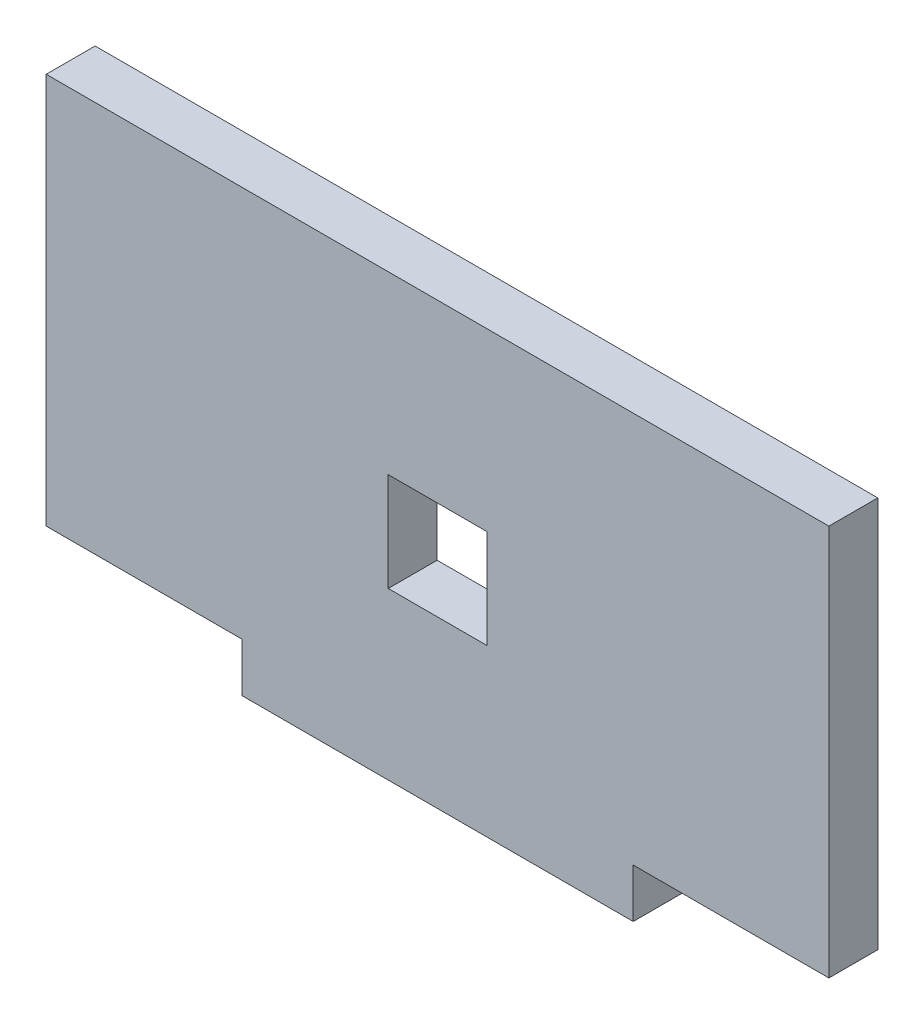
ISO-10303-21;
HEADER;
FILE_DESCRIPTION(('STEP AP214'),'2;1');
FILE_NAME('part.step','',(''),(''),'','','');
FILE_SCHEMA(('AUTOMOTIVE_DESIGN { 1 0 10303 214 1 1 1 1 }'));
ENDSEC;
DATA;
#1=APPLICATION_CONTEXT('core data for automotive mechanical design processes');
#2=APPLICATION_PROTOCOL_DEFINITION('international standard','automotive_design',2000,#1);
#3=PRODUCT_CONTEXT('',#1,'mechanical');
#4=PRODUCT('Part','Part','',(#3));
#5=PRODUCT_RELATED_PRODUCT_CATEGORY('part','',(#4));
#6=PRODUCT_DEFINITION_FORMATION('','',#4);
#7=PRODUCT_DEFINITION_CONTEXT('part definition',#1,'design');
#8=PRODUCT_DEFINITION('design','',#6,#7);
#9=PRODUCT_DEFINITION_SHAPE('','',#8);
#10=(LENGTH_UNIT() NAMED_UNIT(*) SI_UNIT(.MILLI.,.METRE.));
#11=(NAMED_UNIT(*) PLANE_ANGLE_UNIT() SI_UNIT($,.RADIAN.));
#12=(NAMED_UNIT(*) SI_UNIT($,.STERADIAN.) SOLID_ANGLE_UNIT());
#13=UNCERTAINTY_MEASURE_WITH_UNIT(LENGTH_MEASURE(1.E-05),#10,'distance_accuracy_value','');
#14=(GEOMETRIC_REPRESENTATION_CONTEXT(3) GLOBAL_UNCERTAINTY_ASSIGNED_CONTEXT((#13)) GLOBAL_UNIT_ASSIGNED_CONTEXT((#10,
#11,#12)) REPRESENTATION_CONTEXT('',''));
#15=CARTESIAN_POINT('',(0.,0.,0.));
#16=DIRECTION('',(0.,0.,1.));
#17=DIRECTION('',(1.,0.,0.));
#18=AXIS2_PLACEMENT_3D('',#15,#16,#17);
#19=CARTESIAN_POINT('',(25.4,-14.2875,3.175));
#20=DIRECTION('',(-1.,0.,0.));
#21=DIRECTION('',(0.,0.,1.));
#22=AXIS2_PLACEMENT_3D('',#19,#20,#21);
#23=PLANE('',#22);
#24=DIRECTION('',(0.,1.,0.));
#25=VECTOR('',#24,1.);
#26=CARTESIAN_POINT('',(25.4,-14.2875,3.175));
#27=LINE('',#26,#25);
#28=CARTESIAN_POINT('',(25.4,-11.1125,3.175));
#29=VERTEX_POINT('',#28);
#30=CARTESIAN_POINT('',(25.4,14.2875,3.175));
#31=VERTEX_POINT('',#30);
#32=EDGE_CURVE('E136',#29,#31,#27,.T.);
#33=ORIENTED_EDGE('',*,*,#32,.F.);
#34=DIRECTION('',(0.,0.,1.));
#35=VECTOR('',#34,1.);
#36=CARTESIAN_POINT('',(25.4,-11.1125,0.));
#37=LINE('',#36,#35);
#38=CARTESIAN_POINT('',(25.4,-11.1125,0.));
#39=VERTEX_POINT('',#38);
#40=EDGE_CURVE('E124',#39,#29,#37,.T.);
#41=ORIENTED_EDGE('',*,*,#40,.F.);
#42=DIRECTION('',(0.,1.,0.));
#43=VECTOR('',#42,1.);
#44=CARTESIAN_POINT('',(25.4,-14.2875,0.));
#45=LINE('',#44,#43);
#46=CARTESIAN_POINT('',(25.4,14.2875,0.));
#47=VERTEX_POINT('',#46);
#48=EDGE_CURVE('E134',#39,#47,#45,.T.);
#49=ORIENTED_EDGE('',*,*,#48,.T.);
#50=DIRECTION('',(0.,0.,-1.));
#51=VECTOR('',#50,1.);
#52=CARTESIAN_POINT('',(25.4,14.2875,3.175));
#53=LINE('',#52,#51);
#54=EDGE_CURVE('E11',#31,#47,#53,.T.);
#55=ORIENTED_EDGE('',*,*,#54,.F.);
#56=EDGE_LOOP('',(#33,#41,#49,#55));
#57=FACE_BOUND('',#56,.T.);
#58=ADVANCED_FACE('F33',(#57),#23,.F.);
#59=CARTESIAN_POINT('',(-25.4,14.2875,3.175));
#60=DIRECTION('',(0.,-1.,0.));
#61=DIRECTION('',(0.,0.,-1.));
#62=AXIS2_PLACEMENT_3D('',#59,#60,#61);
#63=PLANE('',#62);
#64=DIRECTION('',(-1.,0.,0.));
#65=VECTOR('',#64,1.);
#66=CARTESIAN_POINT('',(-25.4,14.2875,0.));
#67=LINE('',#66,#65);
#68=CARTESIAN_POINT('',(-25.4,14.2875,0.));
#69=VERTEX_POINT('',#68);
#70=EDGE_CURVE('E141',#47,#69,#67,.T.);
#71=ORIENTED_EDGE('',*,*,#70,.T.);
#72=DIRECTION('',(0.,0.,-1.));
#73=VECTOR('',#72,1.);
#74=CARTESIAN_POINT('',(-25.4,14.2875,3.175));
#75=LINE('',#74,#73);
#76=CARTESIAN_POINT('',(-25.4,14.2875,3.175));
#77=VERTEX_POINT('',#76);
#78=EDGE_CURVE('E40',#77,#69,#75,.T.);
#79=ORIENTED_EDGE('',*,*,#78,.F.);
#80=DIRECTION('',(-1.,0.,0.));
#81=VECTOR('',#80,1.);
#82=CARTESIAN_POINT('',(-25.4,14.2875,3.175));
#83=LINE('',#82,#81);
#84=EDGE_CURVE('E168',#31,#77,#83,.T.);
#85=ORIENTED_EDGE('',*,*,#84,.F.);
#86=ORIENTED_EDGE('',*,*,#54,.T.);
#87=EDGE_LOOP('',(#71,#79,#85,#86));
#88=FACE_BOUND('',#87,.T.);
#89=ADVANCED_FACE('F236',(#88),#63,.F.);
#90=CARTESIAN_POINT('',(-25.4,-14.2875,3.175));
#91=DIRECTION('',(1.,0.,0.));
#92=DIRECTION('',(0.,0.,-1.));
#93=AXIS2_PLACEMENT_3D('',#90,#91,#92);
#94=PLANE('',#93);
#95=DIRECTION('',(0.,-1.,0.));
#96=VECTOR('',#95,1.);
#97=CARTESIAN_POINT('',(-25.4,-14.2875,0.));
#98=LINE('',#97,#96);
#99=CARTESIAN_POINT('',(-25.4,-11.1125,0.));
#100=VERTEX_POINT('',#99);
#101=EDGE_CURVE('E144',#69,#100,#98,.T.);
#102=ORIENTED_EDGE('',*,*,#101,.T.);
#103=DIRECTION('',(0.,0.,1.));
#104=VECTOR('',#103,1.);
#105=CARTESIAN_POINT('',(-25.4,-11.1125,0.));
#106=LINE('',#105,#104);
#107=CARTESIAN_POINT('',(-25.4,-11.1125,3.175));
#108=VERTEX_POINT('',#107);
#109=EDGE_CURVE('E142',#100,#108,#106,.T.);
#110=ORIENTED_EDGE('',*,*,#109,.T.);
#111=DIRECTION('',(0.,-1.,0.));
#112=VECTOR('',#111,1.);
#113=CARTESIAN_POINT('',(-25.4,-14.2875,3.175));
#114=LINE('',#113,#112);
#115=EDGE_CURVE('E162',#77,#108,#114,.T.);
#116=ORIENTED_EDGE('',*,*,#115,.F.);
#117=ORIENTED_EDGE('',*,*,#78,.T.);
#118=EDGE_LOOP('',(#102,#110,#116,#117));
#119=FACE_BOUND('',#118,.T.);
#120=ADVANCED_FACE('F234',(#119),#94,.F.);
#121=CARTESIAN_POINT('',(-25.4,-14.2875,3.175));
#122=DIRECTION('',(0.,1.,0.));
#123=DIRECTION('',(0.,0.,1.));
#124=AXIS2_PLACEMENT_3D('',#121,#122,#123);
#125=PLANE('',#124);
#126=DIRECTION('',(1.,0.,0.));
#127=VECTOR('',#126,1.);
#128=CARTESIAN_POINT('',(-25.4,-14.2875,0.));
#129=LINE('',#128,#127);
#130=CARTESIAN_POINT('',(-12.7,-14.2875,0.));
#131=VERTEX_POINT('',#130);
#132=CARTESIAN_POINT('',(12.7,-14.2875,0.));
#133=VERTEX_POINT('',#132);
#134=EDGE_CURVE('E155',#131,#133,#129,.T.);
#135=ORIENTED_EDGE('',*,*,#134,.T.);
#136=DIRECTION('',(0.,0.,1.));
#137=VECTOR('',#136,1.);
#138=CARTESIAN_POINT('',(12.7,-14.2875,0.));
#139=LINE('',#138,#137);
#140=CARTESIAN_POINT('',(12.7,-14.2875,3.175));
#141=VERTEX_POINT('',#140);
#142=EDGE_CURVE('E183',#133,#141,#139,.T.);
#143=ORIENTED_EDGE('',*,*,#142,.T.);
#144=DIRECTION('',(1.,0.,0.));
#145=VECTOR('',#144,1.);
#146=CARTESIAN_POINT('',(-25.4,-14.2875,3.175));
#147=LINE('',#146,#145);
#148=CARTESIAN_POINT('',(-12.7,-14.2875,3.175));
#149=VERTEX_POINT('',#148);
#150=EDGE_CURVE('E150',#149,#141,#147,.T.);
#151=ORIENTED_EDGE('',*,*,#150,.F.);
#152=DIRECTION('',(0.,0.,1.));
#153=VECTOR('',#152,1.);
#154=CARTESIAN_POINT('',(-12.7,-14.2875,0.));
#155=LINE('',#154,#153);
#156=EDGE_CURVE('E173',#131,#149,#155,.T.);
#157=ORIENTED_EDGE('',*,*,#156,.F.);
#158=EDGE_LOOP('',(#135,#143,#151,#157));
#159=FACE_BOUND('',#158,.T.);
#160=ADVANCED_FACE('F227',(#159),#125,.F.);
#161=CARTESIAN_POINT('',(0.,0.,3.175));
#162=DIRECTION('',(0.,0.,-1.));
#163=DIRECTION('',(-1.,0.,0.));
#164=AXIS2_PLACEMENT_3D('',#161,#162,#163);
#165=PLANE('',#164);
#166=DIRECTION('',(-1.,0.,0.));
#167=VECTOR('',#166,1.);
#168=CARTESIAN_POINT('',(-3.2004,2.88290000000001,3.175));
#169=LINE('',#168,#167);
#170=CARTESIAN_POINT('',(3.2004,2.88290000000001,3.175));
#171=VERTEX_POINT('',#170);
#172=CARTESIAN_POINT('',(-3.2004,2.88290000000001,3.175));
#173=VERTEX_POINT('',#172);
#174=EDGE_CURVE('E205',#171,#173,#169,.T.);
#175=ORIENTED_EDGE('',*,*,#174,.F.);
#176=DIRECTION('',(0.,1.,0.));
#177=VECTOR('',#176,1.);
#178=CARTESIAN_POINT('',(3.2004,-3.51789999999999,3.175));
#179=LINE('',#178,#177);
#180=CARTESIAN_POINT('',(3.2004,-3.51789999999999,3.175));
#181=VERTEX_POINT('',#180);
#182=EDGE_CURVE('E47',#181,#171,#179,.T.);
#183=ORIENTED_EDGE('',*,*,#182,.F.);
#184=DIRECTION('',(1.,0.,0.));
#185=VECTOR('',#184,1.);
#186=CARTESIAN_POINT('',(-3.2004,-3.51789999999999,3.175));
#187=LINE('',#186,#185);
#188=CARTESIAN_POINT('',(-3.2004,-3.51789999999999,3.175));
#189=VERTEX_POINT('',#188);
#190=EDGE_CURVE('E198',#189,#181,#187,.T.);
#191=ORIENTED_EDGE('',*,*,#190,.F.);
#192=DIRECTION('',(0.,-1.,0.));
#193=VECTOR('',#192,1.);
#194=CARTESIAN_POINT('',(-3.2004,-3.51789999999999,3.175));
#195=LINE('',#194,#193);
#196=EDGE_CURVE('E202',#173,#189,#195,.T.);
#197=ORIENTED_EDGE('',*,*,#196,.F.);
#198=EDGE_LOOP('',(#175,#183,#191,#197));
#199=FACE_BOUND('',#198,.T.);
#200=ORIENTED_EDGE('',*,*,#150,.T.);
#201=DIRECTION('',(0.,-1.,0.));
#202=VECTOR('',#201,1.);
#203=CARTESIAN_POINT('',(12.7,-14.2875,3.175));
#204=LINE('',#203,#202);
#205=CARTESIAN_POINT('',(12.7,-11.1125,3.175));
#206=VERTEX_POINT('',#205);
#207=EDGE_CURVE('E129',#206,#141,#204,.T.);
#208=ORIENTED_EDGE('',*,*,#207,.F.);
#209=DIRECTION('',(-1.,0.,0.));
#210=VECTOR('',#209,1.);
#211=CARTESIAN_POINT('',(25.4,-11.1125,3.175));
#212=LINE('',#211,#210);
#213=EDGE_CURVE('E197',#29,#206,#212,.T.);
#214=ORIENTED_EDGE('',*,*,#213,.F.);
#215=ORIENTED_EDGE('',*,*,#32,.T.);
#216=ORIENTED_EDGE('',*,*,#84,.T.);
#217=ORIENTED_EDGE('',*,*,#115,.T.);
#218=DIRECTION('',(-1.,0.,0.));
#219=VECTOR('',#218,1.);
#220=CARTESIAN_POINT('',(-25.4,-11.1125,3.175));
#221=LINE('',#220,#219);
#222=CARTESIAN_POINT('',(-12.7,-11.1125,3.175));
#223=VERTEX_POINT('',#222);
#224=EDGE_CURVE('E177',#223,#108,#221,.T.);
#225=ORIENTED_EDGE('',*,*,#224,.F.);
#226=DIRECTION('',(0.,1.,0.));
#227=VECTOR('',#226,1.);
#228=CARTESIAN_POINT('',(-12.7,-14.2875,3.175));
#229=LINE('',#228,#227);
#230=EDGE_CURVE('E180',#149,#223,#229,.T.);
#231=ORIENTED_EDGE('',*,*,#230,.F.);
#232=EDGE_LOOP('',(#200,#208,#214,#215,#216,#217,#225,#231));
#233=FACE_BOUND('',#232,.T.);
#234=ADVANCED_FACE('F231',(#199,#233),#165,.F.);
#235=CARTESIAN_POINT('',(0.,0.,0.));
#236=DIRECTION('',(0.,0.,-1.));
#237=DIRECTION('',(-1.,0.,0.));
#238=AXIS2_PLACEMENT_3D('',#235,#236,#237);
#239=PLANE('',#238);
#240=DIRECTION('',(0.,-1.,0.));
#241=VECTOR('',#240,1.);
#242=CARTESIAN_POINT('',(12.7,-14.2875,0.));
#243=LINE('',#242,#241);
#244=CARTESIAN_POINT('',(12.7,-11.1125,0.));
#245=VERTEX_POINT('',#244);
#246=EDGE_CURVE('E55',#245,#133,#243,.T.);
#247=ORIENTED_EDGE('',*,*,#246,.T.);
#248=ORIENTED_EDGE('',*,*,#134,.F.);
#249=DIRECTION('',(0.,1.,0.));
#250=VECTOR('',#249,1.);
#251=CARTESIAN_POINT('',(-12.7,-14.2875,0.));
#252=LINE('',#251,#250);
#253=CARTESIAN_POINT('',(-12.7,-11.1125,0.));
#254=VERTEX_POINT('',#253);
#255=EDGE_CURVE('E179',#131,#254,#252,.T.);
#256=ORIENTED_EDGE('',*,*,#255,.T.);
#257=DIRECTION('',(-1.,0.,0.));
#258=VECTOR('',#257,1.);
#259=CARTESIAN_POINT('',(-25.4,-11.1125,0.));
#260=LINE('',#259,#258);
#261=EDGE_CURVE('E175',#254,#100,#260,.T.);
#262=ORIENTED_EDGE('',*,*,#261,.T.);
#263=ORIENTED_EDGE('',*,*,#101,.F.);
#264=ORIENTED_EDGE('',*,*,#70,.F.);
#265=ORIENTED_EDGE('',*,*,#48,.F.);
#266=DIRECTION('',(-1.,0.,0.));
#267=VECTOR('',#266,1.);
#268=CARTESIAN_POINT('',(25.4,-11.1125,0.));
#269=LINE('',#268,#267);
#270=EDGE_CURVE('E120',#39,#245,#269,.T.);
#271=ORIENTED_EDGE('',*,*,#270,.T.);
#272=EDGE_LOOP('',(#247,#248,#256,#262,#263,#264,#265,#271));
#273=FACE_BOUND('',#272,.T.);
#274=DIRECTION('',(0.,1.,0.));
#275=VECTOR('',#274,1.);
#276=CARTESIAN_POINT('',(3.2004,-3.51789999999999,0.));
#277=LINE('',#276,#275);
#278=CARTESIAN_POINT('',(3.2004,-3.51789999999999,0.));
#279=VERTEX_POINT('',#278);
#280=CARTESIAN_POINT('',(3.2004,2.88290000000001,0.));
#281=VERTEX_POINT('',#280);
#282=EDGE_CURVE('E201',#279,#281,#277,.T.);
#283=ORIENTED_EDGE('',*,*,#282,.T.);
#284=DIRECTION('',(-1.,0.,0.));
#285=VECTOR('',#284,1.);
#286=CARTESIAN_POINT('',(-3.2004,2.88290000000001,0.));
#287=LINE('',#286,#285);
#288=CARTESIAN_POINT('',(-3.2004,2.88290000000001,0.));
#289=VERTEX_POINT('',#288);
#290=EDGE_CURVE('E214',#281,#289,#287,.T.);
#291=ORIENTED_EDGE('',*,*,#290,.T.);
#292=DIRECTION('',(0.,-1.,0.));
#293=VECTOR('',#292,1.);
#294=CARTESIAN_POINT('',(-3.2004,-3.51789999999999,0.));
#295=LINE('',#294,#293);
#296=CARTESIAN_POINT('',(-3.2004,-3.51789999999999,0.));
#297=VERTEX_POINT('',#296);
#298=EDGE_CURVE('E211',#289,#297,#295,.T.);
#299=ORIENTED_EDGE('',*,*,#298,.T.);
#300=DIRECTION('',(1.,0.,0.));
#301=VECTOR('',#300,1.);
#302=CARTESIAN_POINT('',(-3.2004,-3.51789999999999,0.));
#303=LINE('',#302,#301);
#304=EDGE_CURVE('E191',#297,#279,#303,.T.);
#305=ORIENTED_EDGE('',*,*,#304,.T.);
#306=EDGE_LOOP('',(#283,#291,#299,#305));
#307=FACE_BOUND('',#306,.T.);
#308=ADVANCED_FACE('F138',(#273,#307),#239,.T.);
#309=CARTESIAN_POINT('',(-25.4,-11.1125,0.));
#310=DIRECTION('',(0.,1.,0.));
#311=DIRECTION('',(0.,0.,1.));
#312=AXIS2_PLACEMENT_3D('',#309,#310,#311);
#313=PLANE('',#312);
#314=ORIENTED_EDGE('',*,*,#224,.T.);
#315=ORIENTED_EDGE('',*,*,#109,.F.);
#316=ORIENTED_EDGE('',*,*,#261,.F.);
#317=DIRECTION('',(0.,0.,1.));
#318=VECTOR('',#317,1.);
#319=CARTESIAN_POINT('',(-12.7,-11.1125,0.));
#320=LINE('',#319,#318);
#321=EDGE_CURVE('E147',#254,#223,#320,.T.);
#322=ORIENTED_EDGE('',*,*,#321,.T.);
#323=EDGE_LOOP('',(#314,#315,#316,#322));
#324=FACE_BOUND('',#323,.T.);
#325=ADVANCED_FACE('F233',(#324),#313,.F.);
#326=CARTESIAN_POINT('',(-12.7,-14.2875,0.));
#327=DIRECTION('',(1.,0.,0.));
#328=DIRECTION('',(0.,0.,-1.));
#329=AXIS2_PLACEMENT_3D('',#326,#327,#328);
#330=PLANE('',#329);
#331=ORIENTED_EDGE('',*,*,#230,.T.);
#332=ORIENTED_EDGE('',*,*,#321,.F.);
#333=ORIENTED_EDGE('',*,*,#255,.F.);
#334=ORIENTED_EDGE('',*,*,#156,.T.);
#335=EDGE_LOOP('',(#331,#332,#333,#334));
#336=FACE_BOUND('',#335,.T.);
#337=ADVANCED_FACE('F229',(#336),#330,.F.);
#338=CARTESIAN_POINT('',(3.2004,-3.51789999999999,0.));
#339=DIRECTION('',(1.,0.,0.));
#340=DIRECTION('',(0.,0.,-1.));
#341=AXIS2_PLACEMENT_3D('',#338,#339,#340);
#342=PLANE('',#341);
#343=ORIENTED_EDGE('',*,*,#182,.T.);
#344=DIRECTION('',(0.,0.,1.));
#345=VECTOR('',#344,1.);
#346=CARTESIAN_POINT('',(3.2004,2.88290000000001,0.));
#347=LINE('',#346,#345);
#348=EDGE_CURVE('E188',#281,#171,#347,.T.);
#349=ORIENTED_EDGE('',*,*,#348,.F.);
#350=ORIENTED_EDGE('',*,*,#282,.F.);
#351=DIRECTION('',(0.,0.,1.));
#352=VECTOR('',#351,1.);
#353=CARTESIAN_POINT('',(3.2004,-3.51789999999999,0.));
#354=LINE('',#353,#352);
#355=EDGE_CURVE('E195',#279,#181,#354,.T.);
#356=ORIENTED_EDGE('',*,*,#355,.T.);
#357=EDGE_LOOP('',(#343,#349,#350,#356));
#358=FACE_BOUND('',#357,.T.);
#359=ADVANCED_FACE('F294',(#358),#342,.F.);
#360=CARTESIAN_POINT('',(-3.2004,-3.51789999999999,0.));
#361=DIRECTION('',(0.,-1.,0.));
#362=DIRECTION('',(0.,0.,-1.));
#363=AXIS2_PLACEMENT_3D('',#360,#361,#362);
#364=PLANE('',#363);
#365=ORIENTED_EDGE('',*,*,#190,.T.);
#366=ORIENTED_EDGE('',*,*,#355,.F.);
#367=ORIENTED_EDGE('',*,*,#304,.F.);
#368=DIRECTION('',(0.,0.,1.));
#369=VECTOR('',#368,1.);
#370=CARTESIAN_POINT('',(-3.2004,-3.51789999999999,0.));
#371=LINE('',#370,#369);
#372=EDGE_CURVE('E193',#297,#189,#371,.T.);
#373=ORIENTED_EDGE('',*,*,#372,.T.);
#374=EDGE_LOOP('',(#365,#366,#367,#373));
#375=FACE_BOUND('',#374,.T.);
#376=ADVANCED_FACE('F302',(#375),#364,.F.);
#377=CARTESIAN_POINT('',(-3.2004,-3.51789999999999,0.));
#378=DIRECTION('',(-1.,0.,0.));
#379=DIRECTION('',(0.,0.,1.));
#380=AXIS2_PLACEMENT_3D('',#377,#378,#379);
#381=PLANE('',#380);
#382=ORIENTED_EDGE('',*,*,#196,.T.);
#383=ORIENTED_EDGE('',*,*,#372,.F.);
#384=ORIENTED_EDGE('',*,*,#298,.F.);
#385=DIRECTION('',(0.,0.,1.));
#386=VECTOR('',#385,1.);
#387=CARTESIAN_POINT('',(-3.2004,2.88290000000001,0.));
#388=LINE('',#387,#386);
#389=EDGE_CURVE('E190',#289,#173,#388,.T.);
#390=ORIENTED_EDGE('',*,*,#389,.T.);
#391=EDGE_LOOP('',(#382,#383,#384,#390));
#392=FACE_BOUND('',#391,.T.);
#393=ADVANCED_FACE('F310',(#392),#381,.F.);
#394=CARTESIAN_POINT('',(-3.2004,2.88290000000001,0.));
#395=DIRECTION('',(0.,1.,0.));
#396=DIRECTION('',(0.,0.,1.));
#397=AXIS2_PLACEMENT_3D('',#394,#395,#396);
#398=PLANE('',#397);
#399=ORIENTED_EDGE('',*,*,#174,.T.);
#400=ORIENTED_EDGE('',*,*,#389,.F.);
#401=ORIENTED_EDGE('',*,*,#290,.F.);
#402=ORIENTED_EDGE('',*,*,#348,.T.);
#403=EDGE_LOOP('',(#399,#400,#401,#402));
#404=FACE_BOUND('',#403,.T.);
#405=ADVANCED_FACE('F319',(#404),#398,.F.);
#406=CARTESIAN_POINT('',(12.7,-14.2875,0.));
#407=DIRECTION('',(-1.,0.,0.));
#408=DIRECTION('',(0.,0.,1.));
#409=AXIS2_PLACEMENT_3D('',#406,#407,#408);
#410=PLANE('',#409);
#411=ORIENTED_EDGE('',*,*,#207,.T.);
#412=ORIENTED_EDGE('',*,*,#142,.F.);
#413=ORIENTED_EDGE('',*,*,#246,.F.);
#414=DIRECTION('',(0.,0.,1.));
#415=VECTOR('',#414,1.);
#416=CARTESIAN_POINT('',(12.7,-11.1125,0.));
#417=LINE('',#416,#415);
#418=EDGE_CURVE('E126',#245,#206,#417,.T.);
#419=ORIENTED_EDGE('',*,*,#418,.T.);
#420=EDGE_LOOP('',(#411,#412,#413,#419));
#421=FACE_BOUND('',#420,.T.);
#422=ADVANCED_FACE('F328',(#421),#410,.F.);
#423=CARTESIAN_POINT('',(25.4,-11.1125,0.));
#424=DIRECTION('',(0.,1.,0.));
#425=DIRECTION('',(-1.,0.,0.));
#426=AXIS2_PLACEMENT_3D('',#423,#424,#425);
#427=PLANE('',#426);
#428=ORIENTED_EDGE('',*,*,#213,.T.);
#429=ORIENTED_EDGE('',*,*,#418,.F.);
#430=ORIENTED_EDGE('',*,*,#270,.F.);
#431=ORIENTED_EDGE('',*,*,#40,.T.);
#432=EDGE_LOOP('',(#428,#429,#430,#431));
#433=FACE_BOUND('',#432,.T.);
#434=ADVANCED_FACE('F123',(#433),#427,.F.);
#435=CLOSED_SHELL('',(#58,#89,#120,#160,#234,#308,#325,#337,#359,#376,#393,#405,#422,#434));
#436=MANIFOLD_SOLID_BREP('B2',#435);
#437=ADVANCED_BREP_SHAPE_REPRESENTATION('',(#18,#436),#14);
#438=SHAPE_DEFINITION_REPRESENTATION(#9,#437);
ENDSEC;
END-ISO-10303-21;
